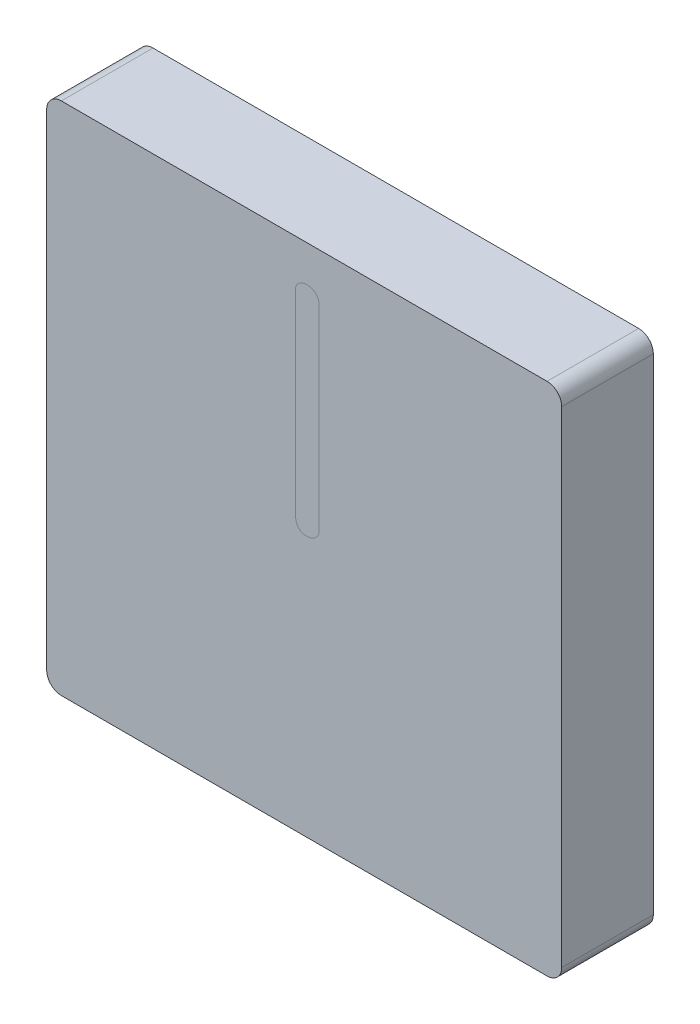
ISO-10303-21;
HEADER;
FILE_DESCRIPTION(('STEP AP214'),'2;1');
FILE_NAME('part.step','',(''),(''),'','','');
FILE_SCHEMA(('AUTOMOTIVE_DESIGN { 1 0 10303 214 1 1 1 1 }'));
ENDSEC;
DATA;
#1=APPLICATION_CONTEXT('core data for automotive mechanical design processes');
#2=APPLICATION_PROTOCOL_DEFINITION('international standard','automotive_design',2000,#1);
#3=PRODUCT_CONTEXT('',#1,'mechanical');
#4=PRODUCT('Part','Part','',(#3));
#5=PRODUCT_RELATED_PRODUCT_CATEGORY('part','',(#4));
#6=PRODUCT_DEFINITION_FORMATION('','',#4);
#7=PRODUCT_DEFINITION_CONTEXT('part definition',#1,'design');
#8=PRODUCT_DEFINITION('design','',#6,#7);
#9=PRODUCT_DEFINITION_SHAPE('','',#8);
#10=(LENGTH_UNIT() NAMED_UNIT(*) SI_UNIT(.MILLI.,.METRE.));
#11=(NAMED_UNIT(*) PLANE_ANGLE_UNIT() SI_UNIT($,.RADIAN.));
#12=(NAMED_UNIT(*) SI_UNIT($,.STERADIAN.) SOLID_ANGLE_UNIT());
#13=UNCERTAINTY_MEASURE_WITH_UNIT(LENGTH_MEASURE(1.E-05),#10,'distance_accuracy_value','');
#14=(GEOMETRIC_REPRESENTATION_CONTEXT(3) GLOBAL_UNCERTAINTY_ASSIGNED_CONTEXT((#13)) GLOBAL_UNIT_ASSIGNED_CONTEXT((#10,
#11,#12)) REPRESENTATION_CONTEXT('',''));
#15=CARTESIAN_POINT('',(0.,0.,0.));
#16=DIRECTION('',(0.,0.,1.));
#17=DIRECTION('',(1.,0.,0.));
#18=AXIS2_PLACEMENT_3D('',#15,#16,#17);
#19=CARTESIAN_POINT('',(4.207,4.207,1.5875));
#20=DIRECTION('',(0.,0.,1.));
#21=DIRECTION('',(1.,0.,0.));
#22=AXIS2_PLACEMENT_3D('',#19,#20,#21);
#23=PLANE('',#22);
#24=CARTESIAN_POINT('',(4.207,4.207,1.5875));
#25=DIRECTION('',(0.,0.,1.));
#26=DIRECTION('',(1.,0.,0.));
#27=AXIS2_PLACEMENT_3D('',#24,#25,#26);
#28=CIRCLE('',#27,0.254000000000002);
#29=CARTESIAN_POINT('',(4.461,4.207,1.5875));
#30=VERTEX_POINT('',#29);
#31=CARTESIAN_POINT('',(4.207,4.461,1.5875));
#32=VERTEX_POINT('',#31);
#33=EDGE_CURVE('E141',#30,#32,#28,.T.);
#34=ORIENTED_EDGE('',*,*,#33,.T.);
#35=DIRECTION('',(-1.,0.,0.));
#36=VECTOR('',#35,1.);
#37=CARTESIAN_POINT('',(4.207,4.461,1.5875));
#38=LINE('',#37,#36);
#39=CARTESIAN_POINT('',(-4.207,4.461,1.5875));
#40=VERTEX_POINT('',#39);
#41=EDGE_CURVE('E130',#32,#40,#38,.T.);
#42=ORIENTED_EDGE('',*,*,#41,.T.);
#43=CARTESIAN_POINT('',(-4.207,4.207,1.5875));
#44=DIRECTION('',(0.,0.,1.));
#45=DIRECTION('',(1.,0.,0.));
#46=AXIS2_PLACEMENT_3D('',#43,#44,#45);
#47=CIRCLE('',#46,0.254);
#48=CARTESIAN_POINT('',(-4.461,4.207,1.5875));
#49=VERTEX_POINT('',#48);
#50=EDGE_CURVE('E140',#40,#49,#47,.T.);
#51=ORIENTED_EDGE('',*,*,#50,.T.);
#52=DIRECTION('',(0.,-1.,0.));
#53=VECTOR('',#52,1.);
#54=CARTESIAN_POINT('',(-4.461,4.207,1.5875));
#55=LINE('',#54,#53);
#56=CARTESIAN_POINT('',(-4.461,-4.207,1.5875));
#57=VERTEX_POINT('',#56);
#58=EDGE_CURVE('E329',#49,#57,#55,.T.);
#59=ORIENTED_EDGE('',*,*,#58,.T.);
#60=CARTESIAN_POINT('',(-4.207,-4.207,1.5875));
#61=DIRECTION('',(0.,0.,1.));
#62=DIRECTION('',(1.,0.,0.));
#63=AXIS2_PLACEMENT_3D('',#60,#61,#62);
#64=CIRCLE('',#63,0.254000000000003);
#65=CARTESIAN_POINT('',(-4.207,-4.461,1.5875));
#66=VERTEX_POINT('',#65);
#67=EDGE_CURVE('E356',#57,#66,#64,.T.);
#68=ORIENTED_EDGE('',*,*,#67,.T.);
#69=DIRECTION('',(1.,0.,0.));
#70=VECTOR('',#69,1.);
#71=CARTESIAN_POINT('',(-4.207,-4.461,1.5875));
#72=LINE('',#71,#70);
#73=CARTESIAN_POINT('',(4.207,-4.461,1.5875));
#74=VERTEX_POINT('',#73);
#75=EDGE_CURVE('E358',#66,#74,#72,.T.);
#76=ORIENTED_EDGE('',*,*,#75,.T.);
#77=CARTESIAN_POINT('',(4.207,-4.207,1.5875));
#78=DIRECTION('',(0.,0.,1.));
#79=DIRECTION('',(1.,0.,0.));
#80=AXIS2_PLACEMENT_3D('',#77,#78,#79);
#81=CIRCLE('',#80,0.254);
#82=CARTESIAN_POINT('',(4.461,-4.207,1.5875));
#83=VERTEX_POINT('',#82);
#84=EDGE_CURVE('E360',#74,#83,#81,.T.);
#85=ORIENTED_EDGE('',*,*,#84,.T.);
#86=DIRECTION('',(0.,1.,0.));
#87=VECTOR('',#86,1.);
#88=CARTESIAN_POINT('',(4.461,-4.207,1.5875));
#89=LINE('',#88,#87);
#90=EDGE_CURVE('E146',#83,#30,#89,.T.);
#91=ORIENTED_EDGE('',*,*,#90,.T.);
#92=EDGE_LOOP('',(#34,#42,#51,#59,#68,#76,#85,#91));
#93=FACE_BOUND('',#92,.T.);
#94=CARTESIAN_POINT('',(-0.154362484598101,0.308600403617946,1.5875));
#95=CARTESIAN_POINT('',(-0.153834804412124,0.288403987137436,1.5875));
#96=CARTESIAN_POINT('',(-0.152840961269366,0.250365662862896,1.5875));
#97=CARTESIAN_POINT('',(-0.142961630471378,0.197689379145704,1.5875));
#98=CARTESIAN_POINT('',(-0.127760756640864,0.152373682946242,1.5875));
#99=CARTESIAN_POINT('',(-0.104661922992305,0.116022617883825,1.5875));
#100=CARTESIAN_POINT('',(-0.0754230345904687,0.0871250329451796,1.5875));
#101=CARTESIAN_POINT('',(-0.0394443825674891,0.0672176614441767,1.5875));
#102=CARTESIAN_POINT('',(0.00324306095138331,0.0566693223415833,1.5875));
#103=CARTESIAN_POINT('',(0.0333325975626404,0.0557193475511667,1.5875));
#104=CARTESIAN_POINT('',(0.0492646227440749,0.0552163480374759,1.5875));
#105=B_SPLINE_CURVE_WITH_KNOTS('',3,(#94,#95,#96,#97,#98,#99,#100,#101,#102,#103,#104),
.UNSPECIFIED.,.F.,.F.,(4,1,1,1,1,1,1,1,4),(0.,0.162458219302187,0.305976975313627,
0.430072284134785,0.545022604258793,0.649454678891509,0.757992626366186,0.871860187790853,1.),.UNSPECIFIED.);
#106=CARTESIAN_POINT('',(0.0492646227440749,0.0552163480374759,1.5875));
#107=VERTEX_POINT('',#106);
#108=CARTESIAN_POINT('',(-0.154362484598101,0.308600403617946,1.5875));
#109=VERTEX_POINT('',#108);
#110=EDGE_CURVE('E51',#107,#109,#105,.F.);
#111=ORIENTED_EDGE('',*,*,#110,.T.);
#112=DIRECTION('',(0.,1.,0.));
#113=VECTOR('',#112,1.);
#114=CARTESIAN_POINT('',(-0.154362484598101,4.207,1.5875));
#115=LINE('',#114,#113);
#116=CARTESIAN_POINT('',(-0.154362484598101,3.57271041196442,1.5875));
#117=VERTEX_POINT('',#116);
#118=EDGE_CURVE('E11',#109,#117,#115,.T.);
#119=ORIENTED_EDGE('',*,*,#118,.T.);
#120=CARTESIAN_POINT('',(-0.133014481409002,3.7385679752028,1.5875));
#121=CARTESIAN_POINT('',(-0.136857544926757,3.72825424200281,1.5875));
#122=CARTESIAN_POINT('',(-0.144510170146635,3.7077166853289,1.5875));
#123=CARTESIAN_POINT('',(-0.151497802120957,3.6723533466904,1.5875));
#124=CARTESIAN_POINT('',(-0.154265249898846,3.62722175707992,1.5875));
#125=CARTESIAN_POINT('',(-0.154326354559324,3.59296549608468,1.5875));
#126=CARTESIAN_POINT('',(-0.154362484598101,3.57271041196442,1.5875));
#127=B_SPLINE_CURVE_WITH_KNOTS('',3,(#120,#121,#122,#123,#124,#125,#126),.UNSPECIFIED.,.F.,.F.,
(4,1,1,1,4),(0.,0.19578161003068,0.38985649849071,0.639233600239729,1.),.UNSPECIFIED.);
#128=CARTESIAN_POINT('',(-0.133014481409002,3.7385679752028,1.5875));
#129=VERTEX_POINT('',#128);
#130=EDGE_CURVE('E155',#117,#129,#127,.F.);
#131=ORIENTED_EDGE('',*,*,#130,.T.);
#132=CARTESIAN_POINT('',(0.0492646227440749,3.83217075841654,1.5875));
#133=CARTESIAN_POINT('',(0.031272509520211,3.83057175603334,1.5875));
#134=CARTESIAN_POINT('',(-0.00520429093277546,3.82732997503017,1.5875));
#135=CARTESIAN_POINT('',(-0.055980932995249,3.8065642981639,1.5875));
#136=CARTESIAN_POINT('',(-0.10194664954697,3.77901873925936,1.5875));
#137=CARTESIAN_POINT('',(-0.123005135397548,3.75160028771395,1.5875));
#138=CARTESIAN_POINT('',(-0.133014481409002,3.7385679752028,1.5875));
#139=B_SPLINE_CURVE_WITH_KNOTS('',3,(#132,#133,#134,#135,#136,#137,#138),.UNSPECIFIED.,.F.,.F.,
(4,1,1,1,4),(0.,0.254027116081574,0.515008787887409,0.769477972490778,1.),.UNSPECIFIED.);
#140=CARTESIAN_POINT('',(0.0492646227440749,3.83217075841654,1.5875));
#141=VERTEX_POINT('',#140);
#142=EDGE_CURVE('E159',#129,#141,#139,.F.);
#143=ORIENTED_EDGE('',*,*,#142,.T.);
#144=CARTESIAN_POINT('',(0.243038805537436,3.71639889496797,1.5875));
#145=CARTESIAN_POINT('',(0.233894964600364,3.73256611146954,1.5875));
#146=CARTESIAN_POINT('',(0.215048908817672,3.76588780485161,1.5875));
#147=CARTESIAN_POINT('',(0.166616411413797,3.80079672716156,1.5875));
#148=CARTESIAN_POINT('',(0.111009837155738,3.82653070221716,1.5875));
#149=CARTESIAN_POINT('',(0.0698073222382564,3.83029430563007,1.5875));
#150=CARTESIAN_POINT('',(0.0492646227440749,3.83217075841654,1.5875));
#151=B_SPLINE_CURVE_WITH_KNOTS('',3,(#144,#145,#146,#147,#148,#149,#150),.UNSPECIFIED.,.F.,.F.,
(4,1,1,1,4),(0.,0.232737956139796,0.479688189497897,0.740583573895314,1.),.UNSPECIFIED.);
#152=CARTESIAN_POINT('',(0.243038805537436,3.71639889496797,1.5875));
#153=VERTEX_POINT('',#152);
#154=EDGE_CURVE('E175',#141,#153,#151,.F.);
#155=ORIENTED_EDGE('',*,*,#154,.T.);
#156=CARTESIAN_POINT('',(0.243038805537436,3.71639889496797,1.5875));
#157=CARTESIAN_POINT('',(0.244153503268108,3.71374671697109,1.5875));
#158=CARTESIAN_POINT('',(0.245269380016504,3.71109344092709,1.5875));
#159=CARTESIAN_POINT('',(0.247438158803375,3.70575539120943,1.5875));
#160=CARTESIAN_POINT('',(0.248490930160303,3.70307056507048,1.5875));
#161=CARTESIAN_POINT('',(0.25045604712383,3.69767008625072,1.5875));
#162=CARTESIAN_POINT('',(0.251369350291311,3.69495479529682,1.5875));
#163=CARTESIAN_POINT('',(0.252996368517008,3.68946764972666,1.5875));
#164=CARTESIAN_POINT('',(0.253710265209147,3.68669584906966,1.5875));
#165=CARTESIAN_POINT('',(0.255565007529381,3.67842038181397,1.5875));
#166=CARTESIAN_POINT('',(0.256453713326724,3.67285983764178,1.5875));
#167=CARTESIAN_POINT('',(0.257695560076511,3.66167875812598,1.5875));
#168=CARTESIAN_POINT('',(0.258047844748925,3.65605814125884,1.5875));
#169=CARTESIAN_POINT('',(0.258506907984573,3.64401760907538,1.5875));
#170=CARTESIAN_POINT('',(0.258572056790182,3.63759675809446,1.5875));
#171=CARTESIAN_POINT('',(0.258722270716704,3.62473540446,1.5875));
#172=CARTESIAN_POINT('',(0.258807398953216,3.61829490472621,1.5875));
#173=CARTESIAN_POINT('',(0.258985075564094,3.60541345101484,1.5875));
#174=CARTESIAN_POINT('',(0.2590776243899,3.59897249703348,1.5875));
#175=CARTESIAN_POINT('',(0.259266911607206,3.5861115617889,1.5875));
#176=CARTESIAN_POINT('',(0.259363635424639,3.57969158031169,1.5875));
#177=CARTESIAN_POINT('',(0.25946114828518,3.57327169510115,1.5875));
#178=B_SPLINE_CURVE_WITH_KNOTS('',3,(#156,#157,#158,#159,#160,#161,#162,#163,#164,#165,#166,
#167,#168,#169,#170,#171,#172,#173,#174,#175,#176,#177),.UNSPECIFIED.,.F.,.F.,(4,2,2,2,2,2,2,2,
2,2,4),(0.,0.00863316284687324,0.017283626404918,0.0258717326501092,0.0344519905221313,
0.0513063027726149,0.0681874911777818,0.0874493982829079,0.106772993391122,0.12609776496845,
0.145359809975955),.UNSPECIFIED.);
#179=CARTESIAN_POINT('',(0.25946114828518,3.57327169510115,1.5875));
#180=VERTEX_POINT('',#179);
#181=EDGE_CURVE('E184',#153,#180,#178,.T.);
#182=ORIENTED_EDGE('',*,*,#181,.T.);
#183=DIRECTION('',(-2.46875786969124E-07,-0.99999999999997,0.));
#184=VECTOR('',#183,1.);
#185=CARTESIAN_POINT('',(0.259461304737594,4.20700097455172,1.5875));
#186=LINE('',#185,#184);
#187=CARTESIAN_POINT('',(0.259460346452126,0.325350696084153,1.5875));
#188=VERTEX_POINT('',#187);
#189=EDGE_CURVE('E196',#180,#188,#186,.T.);
#190=ORIENTED_EDGE('',*,*,#189,.T.);
#191=CARTESIAN_POINT('',(0.232364803942886,0.148819131251218,1.5875));
#192=CARTESIAN_POINT('',(0.237125250450542,0.157972121564384,1.5875));
#193=CARTESIAN_POINT('',(0.246986303792728,0.176932134154271,1.5875));
#194=CARTESIAN_POINT('',(0.255578125318888,0.213236930744917,1.5875));
#195=CARTESIAN_POINT('',(0.258555753811665,0.263164217749347,1.5875));
#196=CARTESIAN_POINT('',(0.259121925044571,0.302085820174664,1.5875));
#197=CARTESIAN_POINT('',(0.259460346452127,0.325350696084152,1.5875));
#198=B_SPLINE_CURVE_WITH_KNOTS('',3,(#191,#192,#193,#194,#195,#196,#197),.UNSPECIFIED.,.F.,.F.,
(4,1,1,1,4),(0.,0.17074009320583,0.353680513801544,0.613671028238261,1.),.UNSPECIFIED.);
#199=CARTESIAN_POINT('',(0.232364803942886,0.148819131251218,1.5875));
#200=VERTEX_POINT('',#199);
#201=EDGE_CURVE('E374',#188,#200,#198,.F.);
#202=ORIENTED_EDGE('',*,*,#201,.T.);
#203=CARTESIAN_POINT('',(0.0492646227440749,0.0552163480374759,1.5875));
#204=CARTESIAN_POINT('',(0.0672291157953281,0.0565163430609451,1.5875));
#205=CARTESIAN_POINT('',(0.102466241584071,0.0590662668487208,1.5875));
#206=CARTESIAN_POINT('',(0.151900642272867,0.0781378037045657,1.5875));
#207=CARTESIAN_POINT('',(0.196458388878651,0.107767585128098,1.5875));
#208=CARTESIAN_POINT('',(0.220081500715905,0.134775719006787,1.5875));
#209=CARTESIAN_POINT('',(0.232364803942886,0.148819131251218,1.5875));
#210=B_SPLINE_CURVE_WITH_KNOTS('',3,(#203,#204,#205,#206,#207,#208,#209),.UNSPECIFIED.,.F.,.F.,
(4,1,1,1,4),(0.,0.25282238125329,0.49590790149295,0.737887364588311,1.),.UNSPECIFIED.);
#211=EDGE_CURVE('E380',#200,#107,#210,.F.);
#212=ORIENTED_EDGE('',*,*,#211,.T.);
#213=EDGE_LOOP('',(#111,#119,#131,#143,#155,#182,#190,#202,#212));
#214=FACE_BOUND('',#213,.T.);
#215=ADVANCED_FACE('F39',(#93,#214),#23,.T.);
#216=CARTESIAN_POINT('',(4.207,4.207,1.5875));
#217=DIRECTION('',(0.,0.,-1.));
#218=DIRECTION('',(-1.,0.,0.));
#219=AXIS2_PLACEMENT_3D('',#216,#217,#218);
#220=CYLINDRICAL_SURFACE('',#219,0.254000000000002);
#221=CARTESIAN_POINT('',(4.207,4.207,0.));
#222=DIRECTION('',(0.,0.,1.));
#223=DIRECTION('',(1.,0.,0.));
#224=AXIS2_PLACEMENT_3D('',#221,#222,#223);
#225=CIRCLE('',#224,0.254000000000002);
#226=CARTESIAN_POINT('',(4.461,4.207,0.));
#227=VERTEX_POINT('',#226);
#228=CARTESIAN_POINT('',(4.207,4.461,0.));
#229=VERTEX_POINT('',#228);
#230=EDGE_CURVE('E154',#227,#229,#225,.T.);
#231=ORIENTED_EDGE('',*,*,#230,.T.);
#232=DIRECTION('',(0.,0.,-1.));
#233=VECTOR('',#232,1.);
#234=CARTESIAN_POINT('',(4.207,4.461,1.5875));
#235=LINE('',#234,#233);
#236=EDGE_CURVE('E134',#32,#229,#235,.T.);
#237=ORIENTED_EDGE('',*,*,#236,.F.);
#238=ORIENTED_EDGE('',*,*,#33,.F.);
#239=DIRECTION('',(0.,0.,-1.));
#240=VECTOR('',#239,1.);
#241=CARTESIAN_POINT('',(4.461,4.207,1.5875));
#242=LINE('',#241,#240);
#243=EDGE_CURVE('E343',#30,#227,#242,.T.);
#244=ORIENTED_EDGE('',*,*,#243,.T.);
#245=EDGE_LOOP('',(#231,#237,#238,#244));
#246=FACE_BOUND('',#245,.T.);
#247=ADVANCED_FACE('F152',(#246),#220,.T.);
#248=CARTESIAN_POINT('',(4.207,4.461,1.5875));
#249=DIRECTION('',(0.,-1.,0.));
#250=DIRECTION('',(0.,0.,-1.));
#251=AXIS2_PLACEMENT_3D('',#248,#249,#250);
#252=PLANE('',#251);
#253=DIRECTION('',(-1.,0.,0.));
#254=VECTOR('',#253,1.);
#255=CARTESIAN_POINT('',(4.207,4.461,0.));
#256=LINE('',#255,#254);
#257=CARTESIAN_POINT('',(-4.207,4.461,0.));
#258=VERTEX_POINT('',#257);
#259=EDGE_CURVE('E325',#229,#258,#256,.T.);
#260=ORIENTED_EDGE('',*,*,#259,.T.);
#261=DIRECTION('',(0.,0.,-1.));
#262=VECTOR('',#261,1.);
#263=CARTESIAN_POINT('',(-4.207,4.461,1.5875));
#264=LINE('',#263,#262);
#265=EDGE_CURVE('E137',#40,#258,#264,.T.);
#266=ORIENTED_EDGE('',*,*,#265,.F.);
#267=ORIENTED_EDGE('',*,*,#41,.F.);
#268=ORIENTED_EDGE('',*,*,#236,.T.);
#269=EDGE_LOOP('',(#260,#266,#267,#268));
#270=FACE_BOUND('',#269,.T.);
#271=ADVANCED_FACE('F132',(#270),#252,.F.);
#272=CARTESIAN_POINT('',(-4.207,4.207,1.5875));
#273=DIRECTION('',(0.,0.,-1.));
#274=DIRECTION('',(-1.,0.,0.));
#275=AXIS2_PLACEMENT_3D('',#272,#273,#274);
#276=CYLINDRICAL_SURFACE('',#275,0.254);
#277=CARTESIAN_POINT('',(-4.207,4.207,0.));
#278=DIRECTION('',(0.,0.,1.));
#279=DIRECTION('',(1.,0.,0.));
#280=AXIS2_PLACEMENT_3D('',#277,#278,#279);
#281=CIRCLE('',#280,0.254);
#282=CARTESIAN_POINT('',(-4.461,4.207,0.));
#283=VERTEX_POINT('',#282);
#284=EDGE_CURVE('E320',#258,#283,#281,.T.);
#285=ORIENTED_EDGE('',*,*,#284,.T.);
#286=DIRECTION('',(0.,0.,-1.));
#287=VECTOR('',#286,1.);
#288=CARTESIAN_POINT('',(-4.461,4.207,1.5875));
#289=LINE('',#288,#287);
#290=EDGE_CURVE('E161',#49,#283,#289,.T.);
#291=ORIENTED_EDGE('',*,*,#290,.F.);
#292=ORIENTED_EDGE('',*,*,#50,.F.);
#293=ORIENTED_EDGE('',*,*,#265,.T.);
#294=EDGE_LOOP('',(#285,#291,#292,#293));
#295=FACE_BOUND('',#294,.T.);
#296=ADVANCED_FACE('F225',(#295),#276,.T.);
#297=CARTESIAN_POINT('',(-4.461,4.207,1.5875));
#298=DIRECTION('',(1.,0.,0.));
#299=DIRECTION('',(0.,0.,-1.));
#300=AXIS2_PLACEMENT_3D('',#297,#298,#299);
#301=PLANE('',#300);
#302=DIRECTION('',(0.,-1.,0.));
#303=VECTOR('',#302,1.);
#304=CARTESIAN_POINT('',(-4.461,4.207,0.));
#305=LINE('',#304,#303);
#306=CARTESIAN_POINT('',(-4.461,-4.207,0.));
#307=VERTEX_POINT('',#306);
#308=EDGE_CURVE('E324',#283,#307,#305,.T.);
#309=ORIENTED_EDGE('',*,*,#308,.T.);
#310=DIRECTION('',(0.,0.,-1.));
#311=VECTOR('',#310,1.);
#312=CARTESIAN_POINT('',(-4.461,-4.207,1.5875));
#313=LINE('',#312,#311);
#314=EDGE_CURVE('E330',#57,#307,#313,.T.);
#315=ORIENTED_EDGE('',*,*,#314,.F.);
#316=ORIENTED_EDGE('',*,*,#58,.F.);
#317=ORIENTED_EDGE('',*,*,#290,.T.);
#318=EDGE_LOOP('',(#309,#315,#316,#317));
#319=FACE_BOUND('',#318,.T.);
#320=ADVANCED_FACE('F221',(#319),#301,.F.);
#321=CARTESIAN_POINT('',(-4.207,-4.207,1.5875));
#322=DIRECTION('',(0.,0.,-1.));
#323=DIRECTION('',(-1.,0.,0.));
#324=AXIS2_PLACEMENT_3D('',#321,#322,#323);
#325=CYLINDRICAL_SURFACE('',#324,0.254000000000003);
#326=CARTESIAN_POINT('',(-4.207,-4.207,0.));
#327=DIRECTION('',(0.,0.,1.));
#328=DIRECTION('',(1.,0.,0.));
#329=AXIS2_PLACEMENT_3D('',#326,#327,#328);
#330=CIRCLE('',#329,0.254000000000003);
#331=CARTESIAN_POINT('',(-4.207,-4.461,0.));
#332=VERTEX_POINT('',#331);
#333=EDGE_CURVE('E333',#307,#332,#330,.T.);
#334=ORIENTED_EDGE('',*,*,#333,.T.);
#335=DIRECTION('',(0.,0.,-1.));
#336=VECTOR('',#335,1.);
#337=CARTESIAN_POINT('',(-4.207,-4.461,1.5875));
#338=LINE('',#337,#336);
#339=EDGE_CURVE('E351',#66,#332,#338,.T.);
#340=ORIENTED_EDGE('',*,*,#339,.F.);
#341=ORIENTED_EDGE('',*,*,#67,.F.);
#342=ORIENTED_EDGE('',*,*,#314,.T.);
#343=EDGE_LOOP('',(#334,#340,#341,#342));
#344=FACE_BOUND('',#343,.T.);
#345=ADVANCED_FACE('F217',(#344),#325,.T.);
#346=CARTESIAN_POINT('',(-4.207,-4.461,1.5875));
#347=DIRECTION('',(0.,1.,0.));
#348=DIRECTION('',(0.,0.,1.));
#349=AXIS2_PLACEMENT_3D('',#346,#347,#348);
#350=PLANE('',#349);
#351=DIRECTION('',(1.,0.,0.));
#352=VECTOR('',#351,1.);
#353=CARTESIAN_POINT('',(-4.207,-4.461,0.));
#354=LINE('',#353,#352);
#355=CARTESIAN_POINT('',(4.207,-4.461,0.));
#356=VERTEX_POINT('',#355);
#357=EDGE_CURVE('E335',#332,#356,#354,.T.);
#358=ORIENTED_EDGE('',*,*,#357,.T.);
#359=DIRECTION('',(0.,0.,-1.));
#360=VECTOR('',#359,1.);
#361=CARTESIAN_POINT('',(4.207,-4.461,1.5875));
#362=LINE('',#361,#360);
#363=EDGE_CURVE('E348',#74,#356,#362,.T.);
#364=ORIENTED_EDGE('',*,*,#363,.F.);
#365=ORIENTED_EDGE('',*,*,#75,.F.);
#366=ORIENTED_EDGE('',*,*,#339,.T.);
#367=EDGE_LOOP('',(#358,#364,#365,#366));
#368=FACE_BOUND('',#367,.T.);
#369=ADVANCED_FACE('F213',(#368),#350,.F.);
#370=CARTESIAN_POINT('',(4.207,-4.207,1.5875));
#371=DIRECTION('',(0.,0.,-1.));
#372=DIRECTION('',(-1.,0.,0.));
#373=AXIS2_PLACEMENT_3D('',#370,#371,#372);
#374=CYLINDRICAL_SURFACE('',#373,0.254);
#375=CARTESIAN_POINT('',(4.207,-4.207,0.));
#376=DIRECTION('',(0.,0.,1.));
#377=DIRECTION('',(1.,0.,0.));
#378=AXIS2_PLACEMENT_3D('',#375,#376,#377);
#379=CIRCLE('',#378,0.254);
#380=CARTESIAN_POINT('',(4.461,-4.207,0.));
#381=VERTEX_POINT('',#380);
#382=EDGE_CURVE('E340',#356,#381,#379,.T.);
#383=ORIENTED_EDGE('',*,*,#382,.T.);
#384=DIRECTION('',(0.,0.,-1.));
#385=VECTOR('',#384,1.);
#386=CARTESIAN_POINT('',(4.461,-4.207,1.5875));
#387=LINE('',#386,#385);
#388=EDGE_CURVE('E345',#83,#381,#387,.T.);
#389=ORIENTED_EDGE('',*,*,#388,.F.);
#390=ORIENTED_EDGE('',*,*,#84,.F.);
#391=ORIENTED_EDGE('',*,*,#363,.T.);
#392=EDGE_LOOP('',(#383,#389,#390,#391));
#393=FACE_BOUND('',#392,.T.);
#394=ADVANCED_FACE('F209',(#393),#374,.T.);
#395=CARTESIAN_POINT('',(4.461,-4.207,1.5875));
#396=DIRECTION('',(-1.,0.,0.));
#397=DIRECTION('',(0.,0.,1.));
#398=AXIS2_PLACEMENT_3D('',#395,#396,#397);
#399=PLANE('',#398);
#400=DIRECTION('',(0.,1.,0.));
#401=VECTOR('',#400,1.);
#402=CARTESIAN_POINT('',(4.461,-4.207,0.));
#403=LINE('',#402,#401);
#404=EDGE_CURVE('E150',#381,#227,#403,.T.);
#405=ORIENTED_EDGE('',*,*,#404,.T.);
#406=ORIENTED_EDGE('',*,*,#243,.F.);
#407=ORIENTED_EDGE('',*,*,#90,.F.);
#408=ORIENTED_EDGE('',*,*,#388,.T.);
#409=EDGE_LOOP('',(#405,#406,#407,#408));
#410=FACE_BOUND('',#409,.T.);
#411=ADVANCED_FACE('F203',(#410),#399,.F.);
#412=ORIENTED_EDGE('',*,*,#118,.F.);
#413=ORIENTED_EDGE('',*,*,#110,.F.);
#414=ORIENTED_EDGE('',*,*,#211,.F.);
#415=ORIENTED_EDGE('',*,*,#201,.F.);
#416=ORIENTED_EDGE('',*,*,#189,.F.);
#417=ORIENTED_EDGE('',*,*,#181,.F.);
#418=ORIENTED_EDGE('',*,*,#154,.F.);
#419=ORIENTED_EDGE('',*,*,#142,.F.);
#420=ORIENTED_EDGE('',*,*,#130,.F.);
#421=EDGE_LOOP('',(#412,#413,#414,#415,#416,#417,#418,#419,#420));
#422=FACE_BOUND('',#421,.T.);
#423=ADVANCED_FACE('F198',(#422),#23,.T.);
#424=CARTESIAN_POINT('',(4.207,4.207,0.));
#425=DIRECTION('',(0.,0.,1.));
#426=DIRECTION('',(1.,0.,0.));
#427=AXIS2_PLACEMENT_3D('',#424,#425,#426);
#428=PLANE('',#427);
#429=ORIENTED_EDGE('',*,*,#230,.F.);
#430=ORIENTED_EDGE('',*,*,#404,.F.);
#431=ORIENTED_EDGE('',*,*,#382,.F.);
#432=ORIENTED_EDGE('',*,*,#357,.F.);
#433=ORIENTED_EDGE('',*,*,#333,.F.);
#434=ORIENTED_EDGE('',*,*,#308,.F.);
#435=ORIENTED_EDGE('',*,*,#284,.F.);
#436=ORIENTED_EDGE('',*,*,#259,.F.);
#437=EDGE_LOOP('',(#429,#430,#431,#432,#433,#434,#435,#436));
#438=FACE_BOUND('',#437,.T.);
#439=ADVANCED_FACE('F202',(#438),#428,.F.);
#440=CLOSED_SHELL('',(#215,#247,#271,#296,#320,#345,#369,#394,#411,#423,#439));
#441=MANIFOLD_SOLID_BREP('B2',#440);
#442=ADVANCED_BREP_SHAPE_REPRESENTATION('',(#18,#441),#14);
#443=SHAPE_DEFINITION_REPRESENTATION(#9,#442);
ENDSEC;
END-ISO-10303-21;
